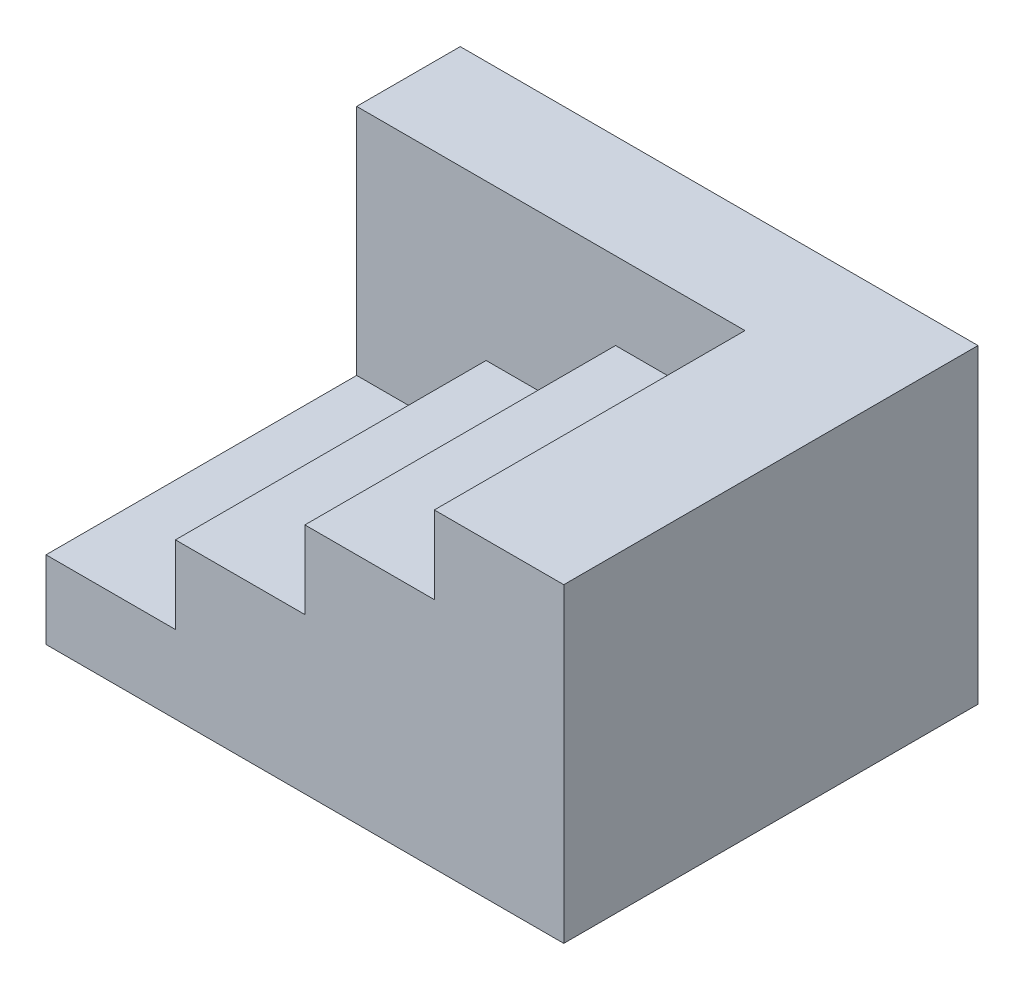
ISO-10303-21;
HEADER;
FILE_DESCRIPTION(('STEP AP214'),'2;1');
FILE_NAME('part.step','',(''),(''),'','','');
FILE_SCHEMA(('AUTOMOTIVE_DESIGN { 1 0 10303 214 1 1 1 1 }'));
ENDSEC;
DATA;
#1=APPLICATION_CONTEXT('core data for automotive mechanical design processes');
#2=APPLICATION_PROTOCOL_DEFINITION('international standard','automotive_design',2000,#1);
#3=PRODUCT_CONTEXT('',#1,'mechanical');
#4=PRODUCT('Part','Part','',(#3));
#5=PRODUCT_RELATED_PRODUCT_CATEGORY('part','',(#4));
#6=PRODUCT_DEFINITION_FORMATION('','',#4);
#7=PRODUCT_DEFINITION_CONTEXT('part definition',#1,'design');
#8=PRODUCT_DEFINITION('design','',#6,#7);
#9=PRODUCT_DEFINITION_SHAPE('','',#8);
#10=(LENGTH_UNIT() NAMED_UNIT(*) SI_UNIT(.MILLI.,.METRE.));
#11=(NAMED_UNIT(*) PLANE_ANGLE_UNIT() SI_UNIT($,.RADIAN.));
#12=(NAMED_UNIT(*) SI_UNIT($,.STERADIAN.) SOLID_ANGLE_UNIT());
#13=UNCERTAINTY_MEASURE_WITH_UNIT(LENGTH_MEASURE(1.E-05),#10,'distance_accuracy_value','');
#14=(GEOMETRIC_REPRESENTATION_CONTEXT(3) GLOBAL_UNCERTAINTY_ASSIGNED_CONTEXT((#13)) GLOBAL_UNIT_ASSIGNED_CONTEXT((#10,
#11,#12)) REPRESENTATION_CONTEXT('',''));
#15=CARTESIAN_POINT('',(0.,0.,0.));
#16=DIRECTION('',(0.,0.,1.));
#17=DIRECTION('',(1.,0.,0.));
#18=AXIS2_PLACEMENT_3D('',#15,#16,#17);
#19=CARTESIAN_POINT('',(-50.,60.,-40.));
#20=DIRECTION('',(1.,0.,0.));
#21=DIRECTION('',(0.,0.,-1.));
#22=AXIS2_PLACEMENT_3D('',#19,#20,#21);
#23=PLANE('',#22);
#24=DIRECTION('',(0.,-1.,0.));
#25=VECTOR('',#24,1.);
#26=CARTESIAN_POINT('',(-50.,60.,40.));
#27=LINE('',#26,#25);
#28=CARTESIAN_POINT('',(-50.,15.,40.));
#29=VERTEX_POINT('',#28);
#30=CARTESIAN_POINT('',(-50.,0.,40.));
#31=VERTEX_POINT('',#30);
#32=EDGE_CURVE('E11',#29,#31,#27,.T.);
#33=ORIENTED_EDGE('',*,*,#32,.F.);
#34=DIRECTION('',(0.,0.,1.));
#35=VECTOR('',#34,1.);
#36=CARTESIAN_POINT('',(-50.,15.,-20.));
#37=LINE('',#36,#35);
#38=CARTESIAN_POINT('',(-50.,15.,-20.));
#39=VERTEX_POINT('',#38);
#40=EDGE_CURVE('E140',#39,#29,#37,.T.);
#41=ORIENTED_EDGE('',*,*,#40,.F.);
#42=DIRECTION('',(0.,-1.,0.));
#43=VECTOR('',#42,1.);
#44=CARTESIAN_POINT('',(-50.,15.,-20.));
#45=LINE('',#44,#43);
#46=CARTESIAN_POINT('',(-50.,60.,-20.));
#47=VERTEX_POINT('',#46);
#48=EDGE_CURVE('E147',#47,#39,#45,.T.);
#49=ORIENTED_EDGE('',*,*,#48,.F.);
#50=DIRECTION('',(0.,0.,1.));
#51=VECTOR('',#50,1.);
#52=CARTESIAN_POINT('',(-50.,60.,-40.));
#53=LINE('',#52,#51);
#54=CARTESIAN_POINT('',(-50.,60.,-40.));
#55=VERTEX_POINT('',#54);
#56=EDGE_CURVE('E169',#55,#47,#53,.T.);
#57=ORIENTED_EDGE('',*,*,#56,.F.);
#58=DIRECTION('',(0.,-1.,0.));
#59=VECTOR('',#58,1.);
#60=CARTESIAN_POINT('',(-50.,60.,-40.));
#61=LINE('',#60,#59);
#62=CARTESIAN_POINT('',(-50.,0.,-40.));
#63=VERTEX_POINT('',#62);
#64=EDGE_CURVE('E179',#55,#63,#61,.T.);
#65=ORIENTED_EDGE('',*,*,#64,.T.);
#66=DIRECTION('',(0.,0.,1.));
#67=VECTOR('',#66,1.);
#68=CARTESIAN_POINT('',(-50.,0.,-40.));
#69=LINE('',#68,#67);
#70=EDGE_CURVE('E180',#63,#31,#69,.T.);
#71=ORIENTED_EDGE('',*,*,#70,.T.);
#72=EDGE_LOOP('',(#33,#41,#49,#57,#65,#71));
#73=FACE_BOUND('',#72,.T.);
#74=ADVANCED_FACE('F43',(#73),#23,.F.);
#75=CARTESIAN_POINT('',(-50.,60.,40.));
#76=DIRECTION('',(0.,0.,-1.));
#77=DIRECTION('',(-1.,0.,0.));
#78=AXIS2_PLACEMENT_3D('',#75,#76,#77);
#79=PLANE('',#78);
#80=DIRECTION('',(1.,0.,0.));
#81=VECTOR('',#80,1.);
#82=CARTESIAN_POINT('',(-50.,60.,40.));
#83=LINE('',#82,#81);
#84=CARTESIAN_POINT('',(25.,60.,40.));
#85=VERTEX_POINT('',#84);
#86=CARTESIAN_POINT('',(50.,60.,40.));
#87=VERTEX_POINT('',#86);
#88=EDGE_CURVE('E91',#85,#87,#83,.T.);
#89=ORIENTED_EDGE('',*,*,#88,.F.);
#90=DIRECTION('',(0.,1.,0.));
#91=VECTOR('',#90,1.);
#92=CARTESIAN_POINT('',(25.,60.,40.));
#93=LINE('',#92,#91);
#94=CARTESIAN_POINT('',(25.,45.,40.));
#95=VERTEX_POINT('',#94);
#96=EDGE_CURVE('E156',#95,#85,#93,.T.);
#97=ORIENTED_EDGE('',*,*,#96,.F.);
#98=DIRECTION('',(1.,0.,0.));
#99=VECTOR('',#98,1.);
#100=CARTESIAN_POINT('',(25.,45.,40.));
#101=LINE('',#100,#99);
#102=CARTESIAN_POINT('',(0.,45.,40.));
#103=VERTEX_POINT('',#102);
#104=EDGE_CURVE('E230',#103,#95,#101,.T.);
#105=ORIENTED_EDGE('',*,*,#104,.F.);
#106=DIRECTION('',(0.,1.,0.));
#107=VECTOR('',#106,1.);
#108=CARTESIAN_POINT('',(0.,45.,40.));
#109=LINE('',#108,#107);
#110=CARTESIAN_POINT('',(0.,30.,40.));
#111=VERTEX_POINT('',#110);
#112=EDGE_CURVE('E235',#111,#103,#109,.T.);
#113=ORIENTED_EDGE('',*,*,#112,.F.);
#114=DIRECTION('',(1.,0.,0.));
#115=VECTOR('',#114,1.);
#116=CARTESIAN_POINT('',(0.,30.,40.));
#117=LINE('',#116,#115);
#118=CARTESIAN_POINT('',(-25.,30.,40.));
#119=VERTEX_POINT('',#118);
#120=EDGE_CURVE('E256',#119,#111,#117,.T.);
#121=ORIENTED_EDGE('',*,*,#120,.F.);
#122=DIRECTION('',(0.,1.,0.));
#123=VECTOR('',#122,1.);
#124=CARTESIAN_POINT('',(-25.,30.,40.));
#125=LINE('',#124,#123);
#126=CARTESIAN_POINT('',(-25.,15.,40.));
#127=VERTEX_POINT('',#126);
#128=EDGE_CURVE('E261',#127,#119,#125,.T.);
#129=ORIENTED_EDGE('',*,*,#128,.F.);
#130=DIRECTION('',(1.,0.,0.));
#131=VECTOR('',#130,1.);
#132=CARTESIAN_POINT('',(-25.,15.,40.));
#133=LINE('',#132,#131);
#134=EDGE_CURVE('E264',#29,#127,#133,.T.);
#135=ORIENTED_EDGE('',*,*,#134,.F.);
#136=ORIENTED_EDGE('',*,*,#32,.T.);
#137=DIRECTION('',(1.,0.,0.));
#138=VECTOR('',#137,1.);
#139=CARTESIAN_POINT('',(-50.,0.,40.));
#140=LINE('',#139,#138);
#141=CARTESIAN_POINT('',(50.,0.,40.));
#142=VERTEX_POINT('',#141);
#143=EDGE_CURVE('E183',#31,#142,#140,.T.);
#144=ORIENTED_EDGE('',*,*,#143,.T.);
#145=DIRECTION('',(0.,-1.,0.));
#146=VECTOR('',#145,1.);
#147=CARTESIAN_POINT('',(50.,60.,40.));
#148=LINE('',#147,#146);
#149=EDGE_CURVE('E51',#87,#142,#148,.T.);
#150=ORIENTED_EDGE('',*,*,#149,.F.);
#151=EDGE_LOOP('',(#89,#97,#105,#113,#121,#129,#135,#136,#144,#150));
#152=FACE_BOUND('',#151,.T.);
#153=ADVANCED_FACE('F217',(#152),#79,.F.);
#154=CARTESIAN_POINT('',(50.,60.,-40.));
#155=DIRECTION('',(-1.,0.,0.));
#156=DIRECTION('',(0.,0.,1.));
#157=AXIS2_PLACEMENT_3D('',#154,#155,#156);
#158=PLANE('',#157);
#159=DIRECTION('',(0.,0.,-1.));
#160=VECTOR('',#159,1.);
#161=CARTESIAN_POINT('',(50.,0.,-40.));
#162=LINE('',#161,#160);
#163=CARTESIAN_POINT('',(50.,0.,-40.));
#164=VERTEX_POINT('',#163);
#165=EDGE_CURVE('E187',#142,#164,#162,.T.);
#166=ORIENTED_EDGE('',*,*,#165,.T.);
#167=DIRECTION('',(0.,-1.,0.));
#168=VECTOR('',#167,1.);
#169=CARTESIAN_POINT('',(50.,60.,-40.));
#170=LINE('',#169,#168);
#171=CARTESIAN_POINT('',(50.,60.,-40.));
#172=VERTEX_POINT('',#171);
#173=EDGE_CURVE('E194',#172,#164,#170,.T.);
#174=ORIENTED_EDGE('',*,*,#173,.F.);
#175=DIRECTION('',(0.,0.,-1.));
#176=VECTOR('',#175,1.);
#177=CARTESIAN_POINT('',(50.,60.,-40.));
#178=LINE('',#177,#176);
#179=EDGE_CURVE('E174',#87,#172,#178,.T.);
#180=ORIENTED_EDGE('',*,*,#179,.F.);
#181=ORIENTED_EDGE('',*,*,#149,.T.);
#182=EDGE_LOOP('',(#166,#174,#180,#181));
#183=FACE_BOUND('',#182,.T.);
#184=ADVANCED_FACE('F201',(#183),#158,.F.);
#185=CARTESIAN_POINT('',(-50.,60.,-40.));
#186=DIRECTION('',(0.,0.,1.));
#187=DIRECTION('',(1.,0.,0.));
#188=AXIS2_PLACEMENT_3D('',#185,#186,#187);
#189=PLANE('',#188);
#190=DIRECTION('',(-1.,0.,0.));
#191=VECTOR('',#190,1.);
#192=CARTESIAN_POINT('',(-50.,0.,-40.));
#193=LINE('',#192,#191);
#194=EDGE_CURVE('E86',#164,#63,#193,.T.);
#195=ORIENTED_EDGE('',*,*,#194,.T.);
#196=ORIENTED_EDGE('',*,*,#64,.F.);
#197=DIRECTION('',(-1.,0.,0.));
#198=VECTOR('',#197,1.);
#199=CARTESIAN_POINT('',(-50.,60.,-40.));
#200=LINE('',#199,#198);
#201=EDGE_CURVE('E67',#172,#55,#200,.T.);
#202=ORIENTED_EDGE('',*,*,#201,.F.);
#203=ORIENTED_EDGE('',*,*,#173,.T.);
#204=EDGE_LOOP('',(#195,#196,#202,#203));
#205=FACE_BOUND('',#204,.T.);
#206=ADVANCED_FACE('F208',(#205),#189,.F.);
#207=CARTESIAN_POINT('',(0.,60.,0.));
#208=DIRECTION('',(0.,1.,0.));
#209=DIRECTION('',(0.,0.,1.));
#210=AXIS2_PLACEMENT_3D('',#207,#208,#209);
#211=PLANE('',#210);
#212=DIRECTION('',(0.,0.,1.));
#213=VECTOR('',#212,1.);
#214=CARTESIAN_POINT('',(25.,60.,-20.));
#215=LINE('',#214,#213);
#216=CARTESIAN_POINT('',(25.,60.,-20.));
#217=VERTEX_POINT('',#216);
#218=EDGE_CURVE('E184',#217,#85,#215,.T.);
#219=ORIENTED_EDGE('',*,*,#218,.T.);
#220=ORIENTED_EDGE('',*,*,#88,.T.);
#221=ORIENTED_EDGE('',*,*,#179,.T.);
#222=ORIENTED_EDGE('',*,*,#201,.T.);
#223=ORIENTED_EDGE('',*,*,#56,.T.);
#224=DIRECTION('',(-1.,0.,0.));
#225=VECTOR('',#224,1.);
#226=CARTESIAN_POINT('',(-50.,60.,-20.));
#227=LINE('',#226,#225);
#228=EDGE_CURVE('E152',#217,#47,#227,.T.);
#229=ORIENTED_EDGE('',*,*,#228,.F.);
#230=EDGE_LOOP('',(#219,#220,#221,#222,#223,#229));
#231=FACE_BOUND('',#230,.T.);
#232=ADVANCED_FACE('F210',(#231),#211,.T.);
#233=CARTESIAN_POINT('',(0.,0.,0.));
#234=DIRECTION('',(0.,1.,0.));
#235=DIRECTION('',(0.,0.,1.));
#236=AXIS2_PLACEMENT_3D('',#233,#234,#235);
#237=PLANE('',#236);
#238=ORIENTED_EDGE('',*,*,#70,.F.);
#239=ORIENTED_EDGE('',*,*,#194,.F.);
#240=ORIENTED_EDGE('',*,*,#165,.F.);
#241=ORIENTED_EDGE('',*,*,#143,.F.);
#242=EDGE_LOOP('',(#238,#239,#240,#241));
#243=FACE_BOUND('',#242,.T.);
#244=ADVANCED_FACE('F207',(#243),#237,.F.);
#245=CARTESIAN_POINT('',(25.,60.,-20.));
#246=DIRECTION('',(1.,0.,0.));
#247=DIRECTION('',(0.,1.,0.));
#248=AXIS2_PLACEMENT_3D('',#245,#246,#247);
#249=PLANE('',#248);
#250=ORIENTED_EDGE('',*,*,#96,.T.);
#251=ORIENTED_EDGE('',*,*,#218,.F.);
#252=DIRECTION('',(0.,1.,0.));
#253=VECTOR('',#252,1.);
#254=CARTESIAN_POINT('',(25.,60.,-20.));
#255=LINE('',#254,#253);
#256=CARTESIAN_POINT('',(25.,45.,-20.));
#257=VERTEX_POINT('',#256);
#258=EDGE_CURVE('E58',#257,#217,#255,.T.);
#259=ORIENTED_EDGE('',*,*,#258,.F.);
#260=DIRECTION('',(0.,0.,1.));
#261=VECTOR('',#260,1.);
#262=CARTESIAN_POINT('',(25.,45.,-20.));
#263=LINE('',#262,#261);
#264=EDGE_CURVE('E241',#257,#95,#263,.T.);
#265=ORIENTED_EDGE('',*,*,#264,.T.);
#266=EDGE_LOOP('',(#250,#251,#259,#265));
#267=FACE_BOUND('',#266,.T.);
#268=ADVANCED_FACE('F291',(#267),#249,.F.);
#269=CARTESIAN_POINT('',(25.,45.,-20.));
#270=DIRECTION('',(0.,-1.,0.));
#271=DIRECTION('',(0.,0.,-1.));
#272=AXIS2_PLACEMENT_3D('',#269,#270,#271);
#273=PLANE('',#272);
#274=ORIENTED_EDGE('',*,*,#104,.T.);
#275=ORIENTED_EDGE('',*,*,#264,.F.);
#276=DIRECTION('',(1.,0.,0.));
#277=VECTOR('',#276,1.);
#278=CARTESIAN_POINT('',(25.,45.,-20.));
#279=LINE('',#278,#277);
#280=CARTESIAN_POINT('',(0.,45.,-20.));
#281=VERTEX_POINT('',#280);
#282=EDGE_CURVE('E275',#281,#257,#279,.T.);
#283=ORIENTED_EDGE('',*,*,#282,.F.);
#284=DIRECTION('',(0.,0.,1.));
#285=VECTOR('',#284,1.);
#286=CARTESIAN_POINT('',(0.,45.,-20.));
#287=LINE('',#286,#285);
#288=EDGE_CURVE('E244',#281,#103,#287,.T.);
#289=ORIENTED_EDGE('',*,*,#288,.T.);
#290=EDGE_LOOP('',(#274,#275,#283,#289));
#291=FACE_BOUND('',#290,.T.);
#292=ADVANCED_FACE('F290',(#291),#273,.F.);
#293=CARTESIAN_POINT('',(0.,45.,-20.));
#294=DIRECTION('',(1.,0.,0.));
#295=DIRECTION('',(0.,1.,0.));
#296=AXIS2_PLACEMENT_3D('',#293,#294,#295);
#297=PLANE('',#296);
#298=ORIENTED_EDGE('',*,*,#112,.T.);
#299=ORIENTED_EDGE('',*,*,#288,.F.);
#300=DIRECTION('',(0.,1.,0.));
#301=VECTOR('',#300,1.);
#302=CARTESIAN_POINT('',(0.,45.,-20.));
#303=LINE('',#302,#301);
#304=CARTESIAN_POINT('',(0.,30.,-20.));
#305=VERTEX_POINT('',#304);
#306=EDGE_CURVE('E278',#305,#281,#303,.T.);
#307=ORIENTED_EDGE('',*,*,#306,.F.);
#308=DIRECTION('',(0.,0.,1.));
#309=VECTOR('',#308,1.);
#310=CARTESIAN_POINT('',(0.,30.,-20.));
#311=LINE('',#310,#309);
#312=EDGE_CURVE('E247',#305,#111,#311,.T.);
#313=ORIENTED_EDGE('',*,*,#312,.T.);
#314=EDGE_LOOP('',(#298,#299,#307,#313));
#315=FACE_BOUND('',#314,.T.);
#316=ADVANCED_FACE('F288',(#315),#297,.F.);
#317=CARTESIAN_POINT('',(0.,30.,-20.));
#318=DIRECTION('',(0.,-1.,0.));
#319=DIRECTION('',(1.,0.,0.));
#320=AXIS2_PLACEMENT_3D('',#317,#318,#319);
#321=PLANE('',#320);
#322=ORIENTED_EDGE('',*,*,#120,.T.);
#323=ORIENTED_EDGE('',*,*,#312,.F.);
#324=DIRECTION('',(1.,0.,0.));
#325=VECTOR('',#324,1.);
#326=CARTESIAN_POINT('',(0.,30.,-20.));
#327=LINE('',#326,#325);
#328=CARTESIAN_POINT('',(-25.,30.,-20.));
#329=VERTEX_POINT('',#328);
#330=EDGE_CURVE('E258',#329,#305,#327,.T.);
#331=ORIENTED_EDGE('',*,*,#330,.F.);
#332=DIRECTION('',(0.,0.,1.));
#333=VECTOR('',#332,1.);
#334=CARTESIAN_POINT('',(-25.,30.,-20.));
#335=LINE('',#334,#333);
#336=EDGE_CURVE('E164',#329,#119,#335,.T.);
#337=ORIENTED_EDGE('',*,*,#336,.T.);
#338=EDGE_LOOP('',(#322,#323,#331,#337));
#339=FACE_BOUND('',#338,.T.);
#340=ADVANCED_FACE('F254',(#339),#321,.F.);
#341=CARTESIAN_POINT('',(-25.,30.,-20.));
#342=DIRECTION('',(1.,0.,0.));
#343=DIRECTION('',(0.,1.,0.));
#344=AXIS2_PLACEMENT_3D('',#341,#342,#343);
#345=PLANE('',#344);
#346=ORIENTED_EDGE('',*,*,#128,.T.);
#347=ORIENTED_EDGE('',*,*,#336,.F.);
#348=DIRECTION('',(0.,1.,0.));
#349=VECTOR('',#348,1.);
#350=CARTESIAN_POINT('',(-25.,30.,-20.));
#351=LINE('',#350,#349);
#352=CARTESIAN_POINT('',(-25.,15.,-20.));
#353=VERTEX_POINT('',#352);
#354=EDGE_CURVE('E146',#353,#329,#351,.T.);
#355=ORIENTED_EDGE('',*,*,#354,.F.);
#356=DIRECTION('',(0.,0.,1.));
#357=VECTOR('',#356,1.);
#358=CARTESIAN_POINT('',(-25.,15.,-20.));
#359=LINE('',#358,#357);
#360=EDGE_CURVE('E142',#353,#127,#359,.T.);
#361=ORIENTED_EDGE('',*,*,#360,.T.);
#362=EDGE_LOOP('',(#346,#347,#355,#361));
#363=FACE_BOUND('',#362,.T.);
#364=ADVANCED_FACE('F262',(#363),#345,.F.);
#365=CARTESIAN_POINT('',(-25.,15.,-20.));
#366=DIRECTION('',(0.,-1.,0.));
#367=DIRECTION('',(1.,0.,0.));
#368=AXIS2_PLACEMENT_3D('',#365,#366,#367);
#369=PLANE('',#368);
#370=ORIENTED_EDGE('',*,*,#134,.T.);
#371=ORIENTED_EDGE('',*,*,#360,.F.);
#372=DIRECTION('',(1.,0.,0.));
#373=VECTOR('',#372,1.);
#374=CARTESIAN_POINT('',(-25.,15.,-20.));
#375=LINE('',#374,#373);
#376=EDGE_CURVE('E135',#39,#353,#375,.T.);
#377=ORIENTED_EDGE('',*,*,#376,.F.);
#378=ORIENTED_EDGE('',*,*,#40,.T.);
#379=EDGE_LOOP('',(#370,#371,#377,#378));
#380=FACE_BOUND('',#379,.T.);
#381=ADVANCED_FACE('F138',(#380),#369,.F.);
#382=CARTESIAN_POINT('',(0.,0.,-20.));
#383=DIRECTION('',(0.,0.,-1.));
#384=DIRECTION('',(-1.,0.,0.));
#385=AXIS2_PLACEMENT_3D('',#382,#383,#384);
#386=PLANE('',#385);
#387=ORIENTED_EDGE('',*,*,#48,.T.);
#388=ORIENTED_EDGE('',*,*,#376,.T.);
#389=ORIENTED_EDGE('',*,*,#354,.T.);
#390=ORIENTED_EDGE('',*,*,#330,.T.);
#391=ORIENTED_EDGE('',*,*,#306,.T.);
#392=ORIENTED_EDGE('',*,*,#282,.T.);
#393=ORIENTED_EDGE('',*,*,#258,.T.);
#394=ORIENTED_EDGE('',*,*,#228,.T.);
#395=EDGE_LOOP('',(#387,#388,#389,#390,#391,#392,#393,#394));
#396=FACE_BOUND('',#395,.T.);
#397=ADVANCED_FACE('F150',(#396),#386,.F.);
#398=CLOSED_SHELL('',(#74,#153,#184,#206,#232,#244,#268,#292,#316,#340,#364,#381,#397));
#399=MANIFOLD_SOLID_BREP('B2',#398);
#400=ADVANCED_BREP_SHAPE_REPRESENTATION('',(#18,#399),#14);
#401=SHAPE_DEFINITION_REPRESENTATION(#9,#400);
ENDSEC;
END-ISO-10303-21;
